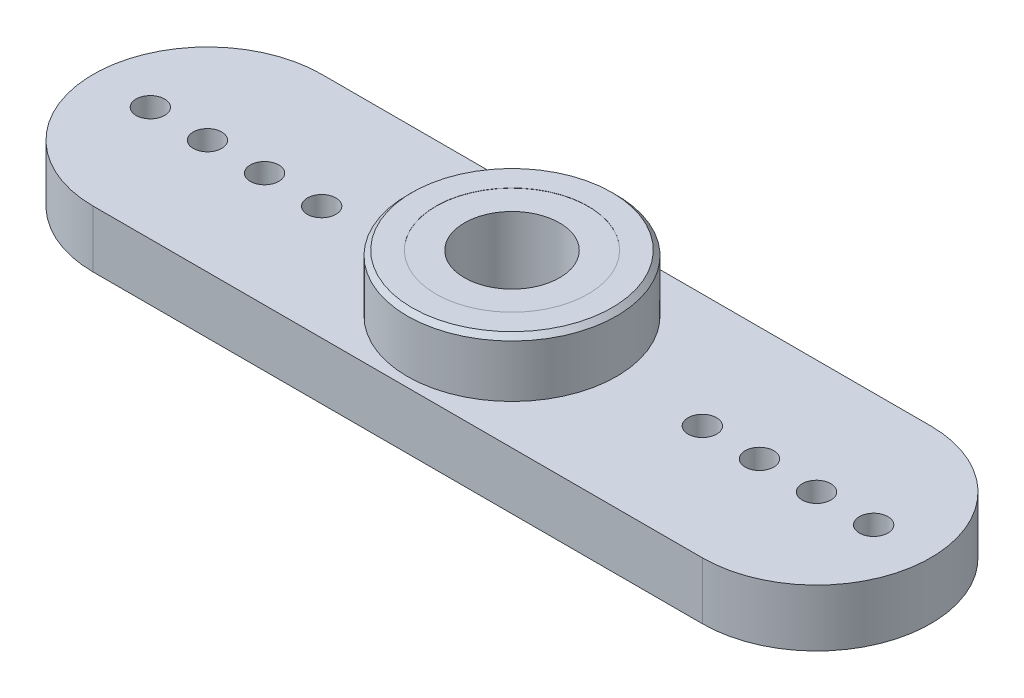
ISO-10303-21;
HEADER;
FILE_DESCRIPTION(('STEP AP214'),'2;1');
FILE_NAME('part.step','',(''),(''),'','','');
FILE_SCHEMA(('AUTOMOTIVE_DESIGN { 1 0 10303 214 1 1 1 1 }'));
ENDSEC;
DATA;
#1=APPLICATION_CONTEXT('core data for automotive mechanical design processes');
#2=APPLICATION_PROTOCOL_DEFINITION('international standard','automotive_design',2000,#1);
#3=PRODUCT_CONTEXT('',#1,'mechanical');
#4=PRODUCT('Part','Part','',(#3));
#5=PRODUCT_RELATED_PRODUCT_CATEGORY('part','',(#4));
#6=PRODUCT_DEFINITION_FORMATION('','',#4);
#7=PRODUCT_DEFINITION_CONTEXT('part definition',#1,'design');
#8=PRODUCT_DEFINITION('design','',#6,#7);
#9=PRODUCT_DEFINITION_SHAPE('','',#8);
#10=(LENGTH_UNIT() NAMED_UNIT(*) SI_UNIT(.MILLI.,.METRE.));
#11=(NAMED_UNIT(*) PLANE_ANGLE_UNIT() SI_UNIT($,.RADIAN.));
#12=(NAMED_UNIT(*) SI_UNIT($,.STERADIAN.) SOLID_ANGLE_UNIT());
#13=UNCERTAINTY_MEASURE_WITH_UNIT(LENGTH_MEASURE(1.E-05),#10,'distance_accuracy_value','');
#14=(GEOMETRIC_REPRESENTATION_CONTEXT(3) GLOBAL_UNCERTAINTY_ASSIGNED_CONTEXT((#13)) GLOBAL_UNIT_ASSIGNED_CONTEXT((#10,
#11,#12)) REPRESENTATION_CONTEXT('',''));
#15=CARTESIAN_POINT('',(0.,0.,0.));
#16=DIRECTION('',(0.,0.,1.));
#17=DIRECTION('',(1.,0.,0.));
#18=AXIS2_PLACEMENT_3D('',#15,#16,#17);
#19=CARTESIAN_POINT('',(-16.,3.,0.));
#20=DIRECTION('',(0.,1.,0.));
#21=DIRECTION('',(0.,0.,1.));
#22=AXIS2_PLACEMENT_3D('',#19,#20,#21);
#23=PLANE('',#22);
#24=CARTESIAN_POINT('',(-13.,3.,0.));
#25=DIRECTION('',(0.,1.,0.));
#26=DIRECTION('',(0.,0.,-1.));
#27=AXIS2_PLACEMENT_3D('',#24,#25,#26);
#28=CIRCLE('',#27,0.749999999999998);
#29=CARTESIAN_POINT('',(-13.,3.,-0.749999999999995));
#30=VERTEX_POINT('',#29);
#31=EDGE_CURVE('E209',#30,#30,#28,.T.);
#32=ORIENTED_EDGE('',*,*,#31,.F.);
#33=EDGE_LOOP('',(#32));
#34=FACE_BOUND('',#33,.T.);
#35=CARTESIAN_POINT('',(-19.,3.,0.));
#36=DIRECTION('',(0.,1.,0.));
#37=DIRECTION('',(0.,0.,-1.));
#38=AXIS2_PLACEMENT_3D('',#35,#36,#37);
#39=CIRCLE('',#38,0.750000000000002);
#40=CARTESIAN_POINT('',(-19.,3.,-0.749999999999997));
#41=VERTEX_POINT('',#40);
#42=EDGE_CURVE('E217',#41,#41,#39,.T.);
#43=ORIENTED_EDGE('',*,*,#42,.F.);
#44=EDGE_LOOP('',(#43));
#45=FACE_BOUND('',#44,.T.);
#46=CARTESIAN_POINT('',(16.,3.,0.));
#47=DIRECTION('',(0.,1.,0.));
#48=DIRECTION('',(0.,0.,1.));
#49=AXIS2_PLACEMENT_3D('',#46,#47,#48);
#50=CIRCLE('',#49,0.750000000000002);
#51=CARTESIAN_POINT('',(16.,3.,0.750000000000002));
#52=VERTEX_POINT('',#51);
#53=EDGE_CURVE('E225',#52,#52,#50,.T.);
#54=ORIENTED_EDGE('',*,*,#53,.F.);
#55=EDGE_LOOP('',(#54));
#56=FACE_BOUND('',#55,.T.);
#57=CARTESIAN_POINT('',(10.,3.,0.));
#58=DIRECTION('',(0.,1.,0.));
#59=DIRECTION('',(0.,0.,1.));
#60=AXIS2_PLACEMENT_3D('',#57,#58,#59);
#61=CIRCLE('',#60,0.75);
#62=CARTESIAN_POINT('',(10.,3.,0.75));
#63=VERTEX_POINT('',#62);
#64=EDGE_CURVE('E107',#63,#63,#61,.T.);
#65=ORIENTED_EDGE('',*,*,#64,.F.);
#66=EDGE_LOOP('',(#65));
#67=FACE_BOUND('',#66,.T.);
#68=CARTESIAN_POINT('',(-16.,3.,0.));
#69=DIRECTION('',(0.,1.,0.));
#70=DIRECTION('',(0.,0.,1.));
#71=AXIS2_PLACEMENT_3D('',#68,#69,#70);
#72=CIRCLE('',#71,6.);
#73=CARTESIAN_POINT('',(-16.,3.,-6.));
#74=VERTEX_POINT('',#73);
#75=CARTESIAN_POINT('',(-16.,3.,6.));
#76=VERTEX_POINT('',#75);
#77=EDGE_CURVE('E89',#74,#76,#72,.T.);
#78=ORIENTED_EDGE('',*,*,#77,.T.);
#79=DIRECTION('',(1.,0.,0.));
#80=VECTOR('',#79,1.);
#81=CARTESIAN_POINT('',(-16.,3.,6.));
#82=LINE('',#81,#80);
#83=CARTESIAN_POINT('',(16.,3.,5.99999999999999));
#84=VERTEX_POINT('',#83);
#85=EDGE_CURVE('E84',#76,#84,#82,.T.);
#86=ORIENTED_EDGE('',*,*,#85,.T.);
#87=CARTESIAN_POINT('',(16.,3.,0.));
#88=DIRECTION('',(0.,1.,0.));
#89=DIRECTION('',(0.,0.,1.));
#90=AXIS2_PLACEMENT_3D('',#87,#88,#89);
#91=CIRCLE('',#90,6.);
#92=CARTESIAN_POINT('',(16.,3.,-6.00000000000001));
#93=VERTEX_POINT('',#92);
#94=EDGE_CURVE('E87',#84,#93,#91,.T.);
#95=ORIENTED_EDGE('',*,*,#94,.T.);
#96=DIRECTION('',(-1.,0.,0.));
#97=VECTOR('',#96,1.);
#98=CARTESIAN_POINT('',(-16.,3.,-6.));
#99=LINE('',#98,#97);
#100=EDGE_CURVE('E53',#93,#74,#99,.T.);
#101=ORIENTED_EDGE('',*,*,#100,.T.);
#102=EDGE_LOOP('',(#78,#86,#95,#101));
#103=FACE_BOUND('',#102,.T.);
#104=CARTESIAN_POINT('',(13.,3.,0.));
#105=DIRECTION('',(0.,1.,0.));
#106=DIRECTION('',(0.,0.,1.));
#107=AXIS2_PLACEMENT_3D('',#104,#105,#106);
#108=CIRCLE('',#107,0.749999999999998);
#109=CARTESIAN_POINT('',(13.,3.,0.749999999999998));
#110=VERTEX_POINT('',#109);
#111=EDGE_CURVE('E229',#110,#110,#108,.T.);
#112=ORIENTED_EDGE('',*,*,#111,.F.);
#113=EDGE_LOOP('',(#112));
#114=FACE_BOUND('',#113,.T.);
#115=CARTESIAN_POINT('',(19.,3.,0.));
#116=DIRECTION('',(0.,1.,0.));
#117=DIRECTION('',(0.,0.,1.));
#118=AXIS2_PLACEMENT_3D('',#115,#116,#117);
#119=CIRCLE('',#118,0.750000000000002);
#120=CARTESIAN_POINT('',(19.,3.,0.750000000000002));
#121=VERTEX_POINT('',#120);
#122=EDGE_CURVE('E221',#121,#121,#119,.T.);
#123=ORIENTED_EDGE('',*,*,#122,.F.);
#124=EDGE_LOOP('',(#123));
#125=FACE_BOUND('',#124,.T.);
#126=CARTESIAN_POINT('',(-16.,3.,0.));
#127=DIRECTION('',(0.,1.,0.));
#128=DIRECTION('',(0.,0.,-1.));
#129=AXIS2_PLACEMENT_3D('',#126,#127,#128);
#130=CIRCLE('',#129,0.75);
#131=CARTESIAN_POINT('',(-16.,3.,-0.749999999999996));
#132=VERTEX_POINT('',#131);
#133=EDGE_CURVE('E213',#132,#132,#130,.T.);
#134=ORIENTED_EDGE('',*,*,#133,.F.);
#135=EDGE_LOOP('',(#134));
#136=FACE_BOUND('',#135,.T.);
#137=CARTESIAN_POINT('',(-10.,3.,0.));
#138=DIRECTION('',(0.,1.,0.));
#139=DIRECTION('',(0.,0.,-1.));
#140=AXIS2_PLACEMENT_3D('',#137,#138,#139);
#141=CIRCLE('',#140,0.75);
#142=CARTESIAN_POINT('',(-10.,3.,-0.749999999999998));
#143=VERTEX_POINT('',#142);
#144=EDGE_CURVE('E203',#143,#143,#141,.T.);
#145=ORIENTED_EDGE('',*,*,#144,.F.);
#146=EDGE_LOOP('',(#145));
#147=FACE_BOUND('',#146,.T.);
#148=CARTESIAN_POINT('',(0.,3.,0.));
#149=DIRECTION('',(0.,1.,0.));
#150=DIRECTION('',(0.,0.,1.));
#151=AXIS2_PLACEMENT_3D('',#148,#149,#150);
#152=CIRCLE('',#151,5.5);
#153=CARTESIAN_POINT('',(0.,3.,5.5));
#154=VERTEX_POINT('',#153);
#155=EDGE_CURVE('E436',#154,#154,#152,.T.);
#156=ORIENTED_EDGE('',*,*,#155,.F.);
#157=EDGE_LOOP('',(#156));
#158=FACE_BOUND('',#157,.T.);
#159=ADVANCED_FACE('F36',(#34,#45,#56,#67,#103,#114,#125,#136,#147,#158),#23,.T.);
#160=CARTESIAN_POINT('',(0.,3.,0.));
#161=DIRECTION('',(0.,-1.,0.));
#162=DIRECTION('',(0.,0.,-1.));
#163=AXIS2_PLACEMENT_3D('',#160,#161,#162);
#164=CYLINDRICAL_SURFACE('',#163,1.5);
#165=CARTESIAN_POINT('',(0.,1.5,0.));
#166=DIRECTION('',(0.,-1.,0.));
#167=DIRECTION('',(0.,0.,-1.));
#168=AXIS2_PLACEMENT_3D('',#165,#166,#167);
#169=CIRCLE('',#168,1.5);
#170=CARTESIAN_POINT('',(0.,1.5,-1.5));
#171=VERTEX_POINT('',#170);
#172=EDGE_CURVE('E114',#171,#171,#169,.T.);
#173=ORIENTED_EDGE('',*,*,#172,.T.);
#174=EDGE_LOOP('',(#173));
#175=FACE_BOUND('',#174,.T.);
#176=CARTESIAN_POINT('',(0.,1.99,0.));
#177=DIRECTION('',(0.,1.,0.));
#178=DIRECTION('',(0.,0.,1.));
#179=AXIS2_PLACEMENT_3D('',#176,#177,#178);
#180=CIRCLE('',#179,1.5);
#181=CARTESIAN_POINT('',(0.,1.99,1.5));
#182=VERTEX_POINT('',#181);
#183=EDGE_CURVE('E119',#182,#182,#180,.T.);
#184=ORIENTED_EDGE('',*,*,#183,.T.);
#185=EDGE_LOOP('',(#184));
#186=FACE_BOUND('',#185,.T.);
#187=ADVANCED_FACE('F140',(#175,#186),#164,.F.);
#188=CARTESIAN_POINT('',(-16.,0.,0.));
#189=DIRECTION('',(0.,1.,0.));
#190=DIRECTION('',(0.,0.,1.));
#191=AXIS2_PLACEMENT_3D('',#188,#189,#190);
#192=PLANE('',#191);
#193=CARTESIAN_POINT('',(0.,0.,0.));
#194=DIRECTION('',(0.,-1.,0.));
#195=DIRECTION('',(0.,0.,-1.));
#196=AXIS2_PLACEMENT_3D('',#193,#194,#195);
#197=CIRCLE('',#196,3.5);
#198=CARTESIAN_POINT('',(0.,0.,-3.5));
#199=VERTEX_POINT('',#198);
#200=EDGE_CURVE('E121',#199,#199,#197,.T.);
#201=ORIENTED_EDGE('',*,*,#200,.F.);
#202=EDGE_LOOP('',(#201));
#203=FACE_BOUND('',#202,.T.);
#204=CARTESIAN_POINT('',(-16.,0.,0.));
#205=DIRECTION('',(0.,1.,0.));
#206=DIRECTION('',(0.,0.,1.));
#207=AXIS2_PLACEMENT_3D('',#204,#205,#206);
#208=CIRCLE('',#207,6.);
#209=CARTESIAN_POINT('',(-16.,0.,-6.));
#210=VERTEX_POINT('',#209);
#211=CARTESIAN_POINT('',(-16.,0.,6.));
#212=VERTEX_POINT('',#211);
#213=EDGE_CURVE('E104',#210,#212,#208,.T.);
#214=ORIENTED_EDGE('',*,*,#213,.F.);
#215=DIRECTION('',(-1.,0.,0.));
#216=VECTOR('',#215,1.);
#217=CARTESIAN_POINT('',(-16.,0.,-6.));
#218=LINE('',#217,#216);
#219=CARTESIAN_POINT('',(16.,0.,-6.00000000000001));
#220=VERTEX_POINT('',#219);
#221=EDGE_CURVE('E76',#220,#210,#218,.T.);
#222=ORIENTED_EDGE('',*,*,#221,.F.);
#223=CARTESIAN_POINT('',(16.,0.,0.));
#224=DIRECTION('',(0.,1.,0.));
#225=DIRECTION('',(0.,0.,1.));
#226=AXIS2_PLACEMENT_3D('',#223,#224,#225);
#227=CIRCLE('',#226,6.);
#228=CARTESIAN_POINT('',(16.,0.,5.99999999999999));
#229=VERTEX_POINT('',#228);
#230=EDGE_CURVE('E70',#229,#220,#227,.T.);
#231=ORIENTED_EDGE('',*,*,#230,.F.);
#232=DIRECTION('',(1.,0.,0.));
#233=VECTOR('',#232,1.);
#234=CARTESIAN_POINT('',(-16.,0.,6.));
#235=LINE('',#234,#233);
#236=EDGE_CURVE('E94',#212,#229,#235,.T.);
#237=ORIENTED_EDGE('',*,*,#236,.F.);
#238=EDGE_LOOP('',(#214,#222,#231,#237));
#239=FACE_BOUND('',#238,.T.);
#240=CARTESIAN_POINT('',(10.,0.,0.));
#241=DIRECTION('',(0.,1.,0.));
#242=DIRECTION('',(0.,0.,1.));
#243=AXIS2_PLACEMENT_3D('',#240,#241,#242);
#244=CIRCLE('',#243,0.75);
#245=CARTESIAN_POINT('',(10.,0.,0.75));
#246=VERTEX_POINT('',#245);
#247=EDGE_CURVE('E175',#246,#246,#244,.T.);
#248=ORIENTED_EDGE('',*,*,#247,.T.);
#249=EDGE_LOOP('',(#248));
#250=FACE_BOUND('',#249,.T.);
#251=CARTESIAN_POINT('',(13.,0.,0.));
#252=DIRECTION('',(0.,1.,0.));
#253=DIRECTION('',(0.,0.,1.));
#254=AXIS2_PLACEMENT_3D('',#251,#252,#253);
#255=CIRCLE('',#254,0.749999999999998);
#256=CARTESIAN_POINT('',(13.,0.,0.749999999999998));
#257=VERTEX_POINT('',#256);
#258=EDGE_CURVE('E179',#257,#257,#255,.T.);
#259=ORIENTED_EDGE('',*,*,#258,.T.);
#260=EDGE_LOOP('',(#259));
#261=FACE_BOUND('',#260,.T.);
#262=CARTESIAN_POINT('',(16.,0.,0.));
#263=DIRECTION('',(0.,1.,0.));
#264=DIRECTION('',(0.,0.,1.));
#265=AXIS2_PLACEMENT_3D('',#262,#263,#264);
#266=CIRCLE('',#265,0.750000000000002);
#267=CARTESIAN_POINT('',(16.,0.,0.750000000000002));
#268=VERTEX_POINT('',#267);
#269=EDGE_CURVE('E183',#268,#268,#266,.T.);
#270=ORIENTED_EDGE('',*,*,#269,.T.);
#271=EDGE_LOOP('',(#270));
#272=FACE_BOUND('',#271,.T.);
#273=CARTESIAN_POINT('',(19.,0.,0.));
#274=DIRECTION('',(0.,1.,0.));
#275=DIRECTION('',(0.,0.,1.));
#276=AXIS2_PLACEMENT_3D('',#273,#274,#275);
#277=CIRCLE('',#276,0.750000000000002);
#278=CARTESIAN_POINT('',(19.,0.,0.750000000000002));
#279=VERTEX_POINT('',#278);
#280=EDGE_CURVE('E187',#279,#279,#277,.T.);
#281=ORIENTED_EDGE('',*,*,#280,.T.);
#282=EDGE_LOOP('',(#281));
#283=FACE_BOUND('',#282,.T.);
#284=CARTESIAN_POINT('',(-19.,0.,0.));
#285=DIRECTION('',(0.,1.,0.));
#286=DIRECTION('',(0.,0.,-1.));
#287=AXIS2_PLACEMENT_3D('',#284,#285,#286);
#288=CIRCLE('',#287,0.750000000000002);
#289=CARTESIAN_POINT('',(-19.,0.,-0.749999999999997));
#290=VERTEX_POINT('',#289);
#291=EDGE_CURVE('E191',#290,#290,#288,.T.);
#292=ORIENTED_EDGE('',*,*,#291,.T.);
#293=EDGE_LOOP('',(#292));
#294=FACE_BOUND('',#293,.T.);
#295=CARTESIAN_POINT('',(-16.,0.,0.));
#296=DIRECTION('',(0.,1.,0.));
#297=DIRECTION('',(0.,0.,-1.));
#298=AXIS2_PLACEMENT_3D('',#295,#296,#297);
#299=CIRCLE('',#298,0.75);
#300=CARTESIAN_POINT('',(-16.,0.,-0.749999999999996));
#301=VERTEX_POINT('',#300);
#302=EDGE_CURVE('E195',#301,#301,#299,.T.);
#303=ORIENTED_EDGE('',*,*,#302,.T.);
#304=EDGE_LOOP('',(#303));
#305=FACE_BOUND('',#304,.T.);
#306=CARTESIAN_POINT('',(-13.,0.,0.));
#307=DIRECTION('',(0.,1.,0.));
#308=DIRECTION('',(0.,0.,-1.));
#309=AXIS2_PLACEMENT_3D('',#306,#307,#308);
#310=CIRCLE('',#309,0.749999999999998);
#311=CARTESIAN_POINT('',(-13.,0.,-0.749999999999995));
#312=VERTEX_POINT('',#311);
#313=EDGE_CURVE('E199',#312,#312,#310,.T.);
#314=ORIENTED_EDGE('',*,*,#313,.T.);
#315=EDGE_LOOP('',(#314));
#316=FACE_BOUND('',#315,.T.);
#317=CARTESIAN_POINT('',(-10.,0.,0.));
#318=DIRECTION('',(0.,1.,0.));
#319=DIRECTION('',(0.,0.,-1.));
#320=AXIS2_PLACEMENT_3D('',#317,#318,#319);
#321=CIRCLE('',#320,0.75);
#322=CARTESIAN_POINT('',(-10.,0.,-0.749999999999998));
#323=VERTEX_POINT('',#322);
#324=EDGE_CURVE('E117',#323,#323,#321,.T.);
#325=ORIENTED_EDGE('',*,*,#324,.T.);
#326=EDGE_LOOP('',(#325));
#327=FACE_BOUND('',#326,.T.);
#328=ADVANCED_FACE('F146',(#203,#239,#250,#261,#272,#283,#294,#305,#316,#327),#192,.F.);
#329=CARTESIAN_POINT('',(-16.,3.,0.));
#330=DIRECTION('',(0.,-1.,0.));
#331=DIRECTION('',(0.,0.,-1.));
#332=AXIS2_PLACEMENT_3D('',#329,#330,#331);
#333=CYLINDRICAL_SURFACE('',#332,6.);
#334=ORIENTED_EDGE('',*,*,#213,.T.);
#335=DIRECTION('',(0.,-1.,0.));
#336=VECTOR('',#335,1.);
#337=CARTESIAN_POINT('',(-16.,3.,6.));
#338=LINE('',#337,#336);
#339=EDGE_CURVE('E95',#76,#212,#338,.T.);
#340=ORIENTED_EDGE('',*,*,#339,.F.);
#341=ORIENTED_EDGE('',*,*,#77,.F.);
#342=DIRECTION('',(0.,-1.,0.));
#343=VECTOR('',#342,1.);
#344=CARTESIAN_POINT('',(-16.,3.,-6.));
#345=LINE('',#344,#343);
#346=EDGE_CURVE('E100',#74,#210,#345,.T.);
#347=ORIENTED_EDGE('',*,*,#346,.T.);
#348=EDGE_LOOP('',(#334,#340,#341,#347));
#349=FACE_BOUND('',#348,.T.);
#350=ADVANCED_FACE('F157',(#349),#333,.T.);
#351=CARTESIAN_POINT('',(-16.,3.,6.));
#352=DIRECTION('',(0.,0.,-1.));
#353=DIRECTION('',(-1.,0.,0.));
#354=AXIS2_PLACEMENT_3D('',#351,#352,#353);
#355=PLANE('',#354);
#356=ORIENTED_EDGE('',*,*,#236,.T.);
#357=DIRECTION('',(0.,-1.,0.));
#358=VECTOR('',#357,1.);
#359=CARTESIAN_POINT('',(16.,3.,5.99999999999999));
#360=LINE('',#359,#358);
#361=EDGE_CURVE('E92',#84,#229,#360,.T.);
#362=ORIENTED_EDGE('',*,*,#361,.F.);
#363=ORIENTED_EDGE('',*,*,#85,.F.);
#364=ORIENTED_EDGE('',*,*,#339,.T.);
#365=EDGE_LOOP('',(#356,#362,#363,#364));
#366=FACE_BOUND('',#365,.T.);
#367=ADVANCED_FACE('F93',(#366),#355,.F.);
#368=CARTESIAN_POINT('',(16.,3.,0.));
#369=DIRECTION('',(0.,-1.,0.));
#370=DIRECTION('',(0.,0.,-1.));
#371=AXIS2_PLACEMENT_3D('',#368,#369,#370);
#372=CYLINDRICAL_SURFACE('',#371,6.);
#373=ORIENTED_EDGE('',*,*,#230,.T.);
#374=DIRECTION('',(0.,-1.,0.));
#375=VECTOR('',#374,1.);
#376=CARTESIAN_POINT('',(16.,3.,-6.00000000000001));
#377=LINE('',#376,#375);
#378=EDGE_CURVE('E96',#93,#220,#377,.T.);
#379=ORIENTED_EDGE('',*,*,#378,.F.);
#380=ORIENTED_EDGE('',*,*,#94,.F.);
#381=ORIENTED_EDGE('',*,*,#361,.T.);
#382=EDGE_LOOP('',(#373,#379,#380,#381));
#383=FACE_BOUND('',#382,.T.);
#384=ADVANCED_FACE('F98',(#383),#372,.T.);
#385=CARTESIAN_POINT('',(-16.,3.,-6.));
#386=DIRECTION('',(0.,0.,1.));
#387=DIRECTION('',(1.,0.,0.));
#388=AXIS2_PLACEMENT_3D('',#385,#386,#387);
#389=PLANE('',#388);
#390=ORIENTED_EDGE('',*,*,#221,.T.);
#391=ORIENTED_EDGE('',*,*,#346,.F.);
#392=ORIENTED_EDGE('',*,*,#100,.F.);
#393=ORIENTED_EDGE('',*,*,#378,.T.);
#394=EDGE_LOOP('',(#390,#391,#392,#393));
#395=FACE_BOUND('',#394,.T.);
#396=ADVANCED_FACE('F159',(#395),#389,.F.);
#397=CARTESIAN_POINT('',(10.,3.,0.));
#398=DIRECTION('',(0.,-1.,0.));
#399=DIRECTION('',(0.,0.,-1.));
#400=AXIS2_PLACEMENT_3D('',#397,#398,#399);
#401=CYLINDRICAL_SURFACE('',#400,0.75);
#402=ORIENTED_EDGE('',*,*,#64,.T.);
#403=EDGE_LOOP('',(#402));
#404=FACE_BOUND('',#403,.T.);
#405=ORIENTED_EDGE('',*,*,#247,.F.);
#406=EDGE_LOOP('',(#405));
#407=FACE_BOUND('',#406,.T.);
#408=ADVANCED_FACE('F153',(#404,#407),#401,.F.);
#409=CARTESIAN_POINT('',(13.,3.,0.));
#410=DIRECTION('',(0.,-1.,0.));
#411=DIRECTION('',(0.,0.,-1.));
#412=AXIS2_PLACEMENT_3D('',#409,#410,#411);
#413=CYLINDRICAL_SURFACE('',#412,0.749999999999998);
#414=ORIENTED_EDGE('',*,*,#111,.T.);
#415=EDGE_LOOP('',(#414));
#416=FACE_BOUND('',#415,.T.);
#417=ORIENTED_EDGE('',*,*,#258,.F.);
#418=EDGE_LOOP('',(#417));
#419=FACE_BOUND('',#418,.T.);
#420=ADVANCED_FACE('F240',(#416,#419),#413,.F.);
#421=CARTESIAN_POINT('',(16.,3.,0.));
#422=DIRECTION('',(0.,-1.,0.));
#423=DIRECTION('',(0.,0.,-1.));
#424=AXIS2_PLACEMENT_3D('',#421,#422,#423);
#425=CYLINDRICAL_SURFACE('',#424,0.750000000000002);
#426=ORIENTED_EDGE('',*,*,#53,.T.);
#427=EDGE_LOOP('',(#426));
#428=FACE_BOUND('',#427,.T.);
#429=ORIENTED_EDGE('',*,*,#269,.F.);
#430=EDGE_LOOP('',(#429));
#431=FACE_BOUND('',#430,.T.);
#432=ADVANCED_FACE('F244',(#428,#431),#425,.F.);
#433=CARTESIAN_POINT('',(19.,3.,0.));
#434=DIRECTION('',(0.,-1.,0.));
#435=DIRECTION('',(0.,0.,-1.));
#436=AXIS2_PLACEMENT_3D('',#433,#434,#435);
#437=CYLINDRICAL_SURFACE('',#436,0.750000000000002);
#438=ORIENTED_EDGE('',*,*,#122,.T.);
#439=EDGE_LOOP('',(#438));
#440=FACE_BOUND('',#439,.T.);
#441=ORIENTED_EDGE('',*,*,#280,.F.);
#442=EDGE_LOOP('',(#441));
#443=FACE_BOUND('',#442,.T.);
#444=ADVANCED_FACE('F249',(#440,#443),#437,.F.);
#445=CARTESIAN_POINT('',(-19.,3.,0.));
#446=DIRECTION('',(0.,-1.,0.));
#447=DIRECTION('',(0.,0.,-1.));
#448=AXIS2_PLACEMENT_3D('',#445,#446,#447);
#449=CYLINDRICAL_SURFACE('',#448,0.750000000000002);
#450=ORIENTED_EDGE('',*,*,#42,.T.);
#451=EDGE_LOOP('',(#450));
#452=FACE_BOUND('',#451,.T.);
#453=ORIENTED_EDGE('',*,*,#291,.F.);
#454=EDGE_LOOP('',(#453));
#455=FACE_BOUND('',#454,.T.);
#456=ADVANCED_FACE('F256',(#452,#455),#449,.F.);
#457=CARTESIAN_POINT('',(-16.,3.,0.));
#458=DIRECTION('',(0.,-1.,0.));
#459=DIRECTION('',(0.,0.,-1.));
#460=AXIS2_PLACEMENT_3D('',#457,#458,#459);
#461=CYLINDRICAL_SURFACE('',#460,0.75);
#462=ORIENTED_EDGE('',*,*,#133,.T.);
#463=EDGE_LOOP('',(#462));
#464=FACE_BOUND('',#463,.T.);
#465=ORIENTED_EDGE('',*,*,#302,.F.);
#466=EDGE_LOOP('',(#465));
#467=FACE_BOUND('',#466,.T.);
#468=ADVANCED_FACE('F260',(#464,#467),#461,.F.);
#469=CARTESIAN_POINT('',(-13.,3.,0.));
#470=DIRECTION('',(0.,-1.,0.));
#471=DIRECTION('',(0.,0.,-1.));
#472=AXIS2_PLACEMENT_3D('',#469,#470,#471);
#473=CYLINDRICAL_SURFACE('',#472,0.749999999999998);
#474=ORIENTED_EDGE('',*,*,#31,.T.);
#475=EDGE_LOOP('',(#474));
#476=FACE_BOUND('',#475,.T.);
#477=ORIENTED_EDGE('',*,*,#313,.F.);
#478=EDGE_LOOP('',(#477));
#479=FACE_BOUND('',#478,.T.);
#480=ADVANCED_FACE('F264',(#476,#479),#473,.F.);
#481=CARTESIAN_POINT('',(-10.,3.,0.));
#482=DIRECTION('',(0.,-1.,0.));
#483=DIRECTION('',(0.,0.,-1.));
#484=AXIS2_PLACEMENT_3D('',#481,#482,#483);
#485=CYLINDRICAL_SURFACE('',#484,0.75);
#486=ORIENTED_EDGE('',*,*,#144,.T.);
#487=EDGE_LOOP('',(#486));
#488=FACE_BOUND('',#487,.T.);
#489=ORIENTED_EDGE('',*,*,#324,.F.);
#490=EDGE_LOOP('',(#489));
#491=FACE_BOUND('',#490,.T.);
#492=ADVANCED_FACE('F268',(#488,#491),#485,.F.);
#493=CARTESIAN_POINT('',(0.,1.5,0.));
#494=DIRECTION('',(0.,-1.,0.));
#495=DIRECTION('',(0.,0.,-1.));
#496=AXIS2_PLACEMENT_3D('',#493,#494,#495);
#497=CYLINDRICAL_SURFACE('',#496,3.5);
#498=CARTESIAN_POINT('',(0.,1.5,0.));
#499=DIRECTION('',(0.,-1.,0.));
#500=DIRECTION('',(0.,0.,-1.));
#501=AXIS2_PLACEMENT_3D('',#498,#499,#500);
#502=CIRCLE('',#501,3.5);
#503=CARTESIAN_POINT('',(0.,1.5,-3.5));
#504=VERTEX_POINT('',#503);
#505=EDGE_CURVE('E118',#504,#504,#502,.T.);
#506=ORIENTED_EDGE('',*,*,#505,.F.);
#507=EDGE_LOOP('',(#506));
#508=FACE_BOUND('',#507,.T.);
#509=ORIENTED_EDGE('',*,*,#200,.T.);
#510=EDGE_LOOP('',(#509));
#511=FACE_BOUND('',#510,.T.);
#512=ADVANCED_FACE('F271',(#508,#511),#497,.F.);
#513=CARTESIAN_POINT('',(0.,1.5,0.));
#514=DIRECTION('',(0.,-1.,0.));
#515=DIRECTION('',(0.,0.,-1.));
#516=AXIS2_PLACEMENT_3D('',#513,#514,#515);
#517=PLANE('',#516);
#518=ORIENTED_EDGE('',*,*,#172,.F.);
#519=EDGE_LOOP('',(#518));
#520=FACE_BOUND('',#519,.T.);
#521=ORIENTED_EDGE('',*,*,#505,.T.);
#522=EDGE_LOOP('',(#521));
#523=FACE_BOUND('',#522,.T.);
#524=ADVANCED_FACE('F276',(#520,#523),#517,.T.);
#525=CARTESIAN_POINT('',(0.,5.99,0.));
#526=DIRECTION('',(0.,1.,0.));
#527=DIRECTION('',(0.,0.,1.));
#528=AXIS2_PLACEMENT_3D('',#525,#526,#527);
#529=PLANE('',#528);
#530=CARTESIAN_POINT('',(0.,5.99,0.));
#531=DIRECTION('',(0.,1.,0.));
#532=DIRECTION('',(0.,0.,1.));
#533=AXIS2_PLACEMENT_3D('',#530,#531,#532);
#534=CIRCLE('',#533,2.5);
#535=CARTESIAN_POINT('',(0.,5.99,2.5));
#536=VERTEX_POINT('',#535);
#537=EDGE_CURVE('E442',#536,#536,#534,.T.);
#538=ORIENTED_EDGE('',*,*,#537,.F.);
#539=EDGE_LOOP('',(#538));
#540=FACE_BOUND('',#539,.T.);
#541=CARTESIAN_POINT('',(0.,5.99,0.));
#542=DIRECTION('',(0.,1.,0.));
#543=DIRECTION('',(0.,0.,1.));
#544=AXIS2_PLACEMENT_3D('',#541,#542,#543);
#545=CIRCLE('',#544,4.);
#546=CARTESIAN_POINT('',(0.,5.99,4.));
#547=VERTEX_POINT('',#546);
#548=EDGE_CURVE('E438',#547,#547,#545,.F.);
#549=ORIENTED_EDGE('',*,*,#548,.F.);
#550=EDGE_LOOP('',(#549));
#551=FACE_BOUND('',#550,.T.);
#552=ADVANCED_FACE('F280',(#540,#551),#529,.T.);
#553=CARTESIAN_POINT('',(0.,1.99,0.));
#554=DIRECTION('',(0.,1.,0.));
#555=DIRECTION('',(0.,0.,1.));
#556=AXIS2_PLACEMENT_3D('',#553,#554,#555);
#557=CYLINDRICAL_SURFACE('',#556,2.5);
#558=CARTESIAN_POINT('',(0.,1.99,0.));
#559=DIRECTION('',(0.,1.,0.));
#560=DIRECTION('',(0.,0.,1.));
#561=AXIS2_PLACEMENT_3D('',#558,#559,#560);
#562=CIRCLE('',#561,2.5);
#563=CARTESIAN_POINT('',(0.,1.99,2.5));
#564=VERTEX_POINT('',#563);
#565=EDGE_CURVE('E122',#564,#564,#562,.T.);
#566=ORIENTED_EDGE('',*,*,#565,.F.);
#567=EDGE_LOOP('',(#566));
#568=FACE_BOUND('',#567,.T.);
#569=ORIENTED_EDGE('',*,*,#537,.T.);
#570=EDGE_LOOP('',(#569));
#571=FACE_BOUND('',#570,.T.);
#572=ADVANCED_FACE('F284',(#568,#571),#557,.F.);
#573=CARTESIAN_POINT('',(0.,1.99,0.));
#574=DIRECTION('',(0.,1.,0.));
#575=DIRECTION('',(0.,0.,1.));
#576=AXIS2_PLACEMENT_3D('',#573,#574,#575);
#577=PLANE('',#576);
#578=ORIENTED_EDGE('',*,*,#183,.F.);
#579=EDGE_LOOP('',(#578));
#580=FACE_BOUND('',#579,.T.);
#581=ORIENTED_EDGE('',*,*,#565,.T.);
#582=EDGE_LOOP('',(#581));
#583=FACE_BOUND('',#582,.T.);
#584=ADVANCED_FACE('F288',(#580,#583),#577,.T.);
#585=CARTESIAN_POINT('',(0.,6.,0.));
#586=DIRECTION('',(0.,1.,0.));
#587=DIRECTION('',(0.,0.,1.));
#588=AXIS2_PLACEMENT_3D('',#585,#586,#587);
#589=PLANE('',#588);
#590=CARTESIAN_POINT('',(0.,6.,0.));
#591=DIRECTION('',(0.,1.,0.));
#592=DIRECTION('',(0.,0.,1.));
#593=AXIS2_PLACEMENT_3D('',#590,#591,#592);
#594=CIRCLE('',#593,5.24999999999999);
#595=CARTESIAN_POINT('',(0.,6.,5.24999999999999));
#596=VERTEX_POINT('',#595);
#597=EDGE_CURVE('E45',#596,#596,#594,.T.);
#598=ORIENTED_EDGE('',*,*,#597,.T.);
#599=EDGE_LOOP('',(#598));
#600=FACE_BOUND('',#599,.T.);
#601=CARTESIAN_POINT('',(0.,6.,0.));
#602=DIRECTION('',(0.,1.,0.));
#603=DIRECTION('',(0.,0.,1.));
#604=AXIS2_PLACEMENT_3D('',#601,#602,#603);
#605=CIRCLE('',#604,4.);
#606=CARTESIAN_POINT('',(0.,6.,4.));
#607=VERTEX_POINT('',#606);
#608=EDGE_CURVE('E439',#607,#607,#605,.T.);
#609=ORIENTED_EDGE('',*,*,#608,.F.);
#610=EDGE_LOOP('',(#609));
#611=FACE_BOUND('',#610,.T.);
#612=ADVANCED_FACE('F126',(#600,#611),#589,.T.);
#613=CARTESIAN_POINT('',(0.,6.,0.));
#614=DIRECTION('',(0.,-1.,0.));
#615=DIRECTION('',(0.,0.,-1.));
#616=AXIS2_PLACEMENT_3D('',#613,#614,#615);
#617=CYLINDRICAL_SURFACE('',#616,5.5);
#618=CARTESIAN_POINT('',(0.,5.74999999999999,0.));
#619=DIRECTION('',(0.,1.,0.));
#620=DIRECTION('',(0.,0.,1.));
#621=AXIS2_PLACEMENT_3D('',#618,#619,#620);
#622=CIRCLE('',#621,5.5);
#623=CARTESIAN_POINT('',(0.,5.74999999999999,5.5));
#624=VERTEX_POINT('',#623);
#625=EDGE_CURVE('E11',#624,#624,#622,.F.);
#626=ORIENTED_EDGE('',*,*,#625,.T.);
#627=EDGE_LOOP('',(#626));
#628=FACE_BOUND('',#627,.T.);
#629=ORIENTED_EDGE('',*,*,#155,.T.);
#630=EDGE_LOOP('',(#629));
#631=FACE_BOUND('',#630,.T.);
#632=ADVANCED_FACE('F135',(#628,#631),#617,.T.);
#633=CARTESIAN_POINT('',(0.,6.,0.));
#634=DIRECTION('',(0.,-1.,0.));
#635=DIRECTION('',(0.,0.,-1.));
#636=AXIS2_PLACEMENT_3D('',#633,#634,#635);
#637=CYLINDRICAL_SURFACE('',#636,4.);
#638=ORIENTED_EDGE('',*,*,#548,.T.);
#639=EDGE_LOOP('',(#638));
#640=FACE_BOUND('',#639,.T.);
#641=ORIENTED_EDGE('',*,*,#608,.T.);
#642=EDGE_LOOP('',(#641));
#643=FACE_BOUND('',#642,.T.);
#644=ADVANCED_FACE('F130',(#640,#643),#637,.F.);
#645=CARTESIAN_POINT('',(0.,6.,0.));
#646=DIRECTION('',(0.,-1.,0.));
#647=DIRECTION('',(0.,0.,-1.));
#648=AXIS2_PLACEMENT_3D('',#645,#646,#647);
#649=CONICAL_SURFACE('',#648,5.24999999999999,0.785398163397452);
#650=ORIENTED_EDGE('',*,*,#625,.F.);
#651=EDGE_LOOP('',(#650));
#652=FACE_BOUND('',#651,.T.);
#653=ORIENTED_EDGE('',*,*,#597,.F.);
#654=EDGE_LOOP('',(#653));
#655=FACE_BOUND('',#654,.T.);
#656=ADVANCED_FACE('F38',(#652,#655),#649,.T.);
#657=CLOSED_SHELL('',(#159,#187,#328,#350,#367,#384,#396,#408,#420,#432,#444,#456,#468,#480,
#492,#512,#524,#552,#572,#584,#612,#632,#644,#656));
#658=MANIFOLD_SOLID_BREP('B2',#657);
#659=ADVANCED_BREP_SHAPE_REPRESENTATION('',(#18,#658),#14);
#660=SHAPE_DEFINITION_REPRESENTATION(#9,#659);
ENDSEC;
END-ISO-10303-21;
